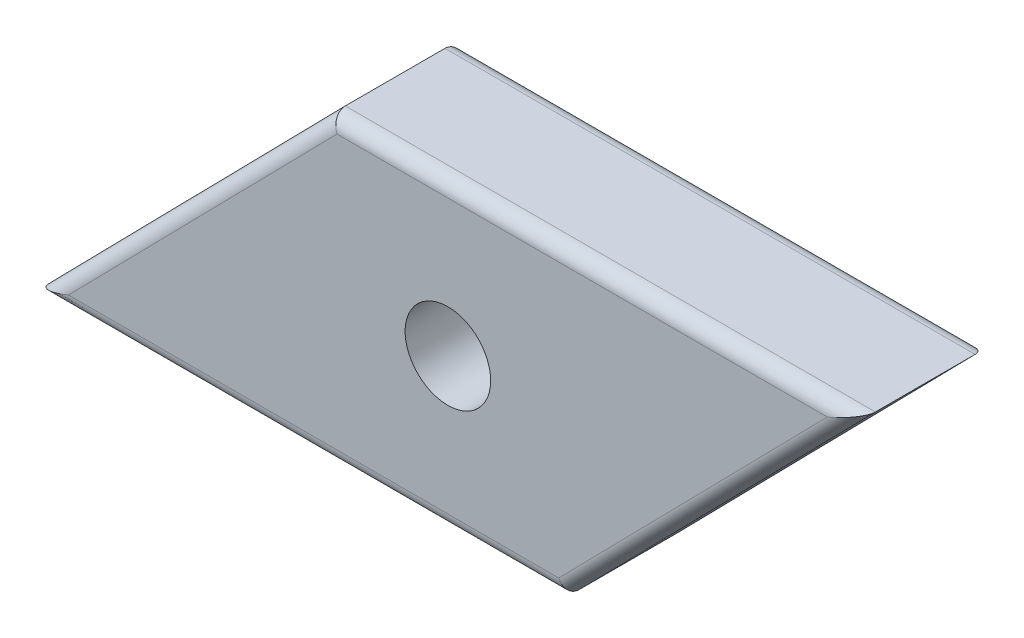
ISO-10303-21;
HEADER;
FILE_DESCRIPTION(('STEP AP214'),'2;1');
FILE_NAME('part.step','',(''),(''),'','','');
FILE_SCHEMA(('AUTOMOTIVE_DESIGN { 1 0 10303 214 1 1 1 1 }'));
ENDSEC;
DATA;
#1=APPLICATION_CONTEXT('core data for automotive mechanical design processes');
#2=APPLICATION_PROTOCOL_DEFINITION('international standard','automotive_design',2000,#1);
#3=PRODUCT_CONTEXT('',#1,'mechanical');
#4=PRODUCT('Part','Part','',(#3));
#5=PRODUCT_RELATED_PRODUCT_CATEGORY('part','',(#4));
#6=PRODUCT_DEFINITION_FORMATION('','',#4);
#7=PRODUCT_DEFINITION_CONTEXT('part definition',#1,'design');
#8=PRODUCT_DEFINITION('design','',#6,#7);
#9=PRODUCT_DEFINITION_SHAPE('','',#8);
#10=(LENGTH_UNIT() NAMED_UNIT(*) SI_UNIT(.MILLI.,.METRE.));
#11=(NAMED_UNIT(*) PLANE_ANGLE_UNIT() SI_UNIT($,.RADIAN.));
#12=(NAMED_UNIT(*) SI_UNIT($,.STERADIAN.) SOLID_ANGLE_UNIT());
#13=UNCERTAINTY_MEASURE_WITH_UNIT(LENGTH_MEASURE(1.E-05),#10,'distance_accuracy_value','');
#14=(GEOMETRIC_REPRESENTATION_CONTEXT(3) GLOBAL_UNCERTAINTY_ASSIGNED_CONTEXT((#13)) GLOBAL_UNIT_ASSIGNED_CONTEXT((#10,
#11,#12)) REPRESENTATION_CONTEXT('',''));
#15=CARTESIAN_POINT('',(0.,0.,0.));
#16=DIRECTION('',(0.,0.,1.));
#17=DIRECTION('',(1.,0.,0.));
#18=AXIS2_PLACEMENT_3D('',#15,#16,#17);
#19=CARTESIAN_POINT('',(0.,0.,4.5));
#20=DIRECTION('',(0.,0.,-1.));
#21=DIRECTION('',(-1.,0.,0.));
#22=AXIS2_PLACEMENT_3D('',#19,#20,#21);
#23=PLANE('',#22);
#24=DIRECTION('',(1.,0.,0.));
#25=VECTOR('',#24,1.);
#26=CARTESIAN_POINT('',(0.,-4.8,4.5));
#27=LINE('',#26,#25);
#28=CARTESIAN_POINT('',(-13.308966234685,-4.8,4.5));
#29=VERTEX_POINT('',#28);
#30=CARTESIAN_POINT('',(3.89009831015675,-4.8,4.5));
#31=VERTEX_POINT('',#30);
#32=EDGE_CURVE('E115',#29,#31,#27,.T.);
#33=ORIENTED_EDGE('',*,*,#32,.T.);
#34=DIRECTION('',(0.700340670128076,0.713808759938233,0.));
#35=VECTOR('',#34,1.);
#36=CARTESIAN_POINT('',(4.38165901564127,-4.29898620402539,4.5));
#37=LINE('',#36,#35);
#38=CARTESIAN_POINT('',(13.308966234685,4.8,4.5));
#39=VERTEX_POINT('',#38);
#40=EDGE_CURVE('E9',#31,#39,#37,.T.);
#41=ORIENTED_EDGE('',*,*,#40,.T.);
#42=DIRECTION('',(-1.,0.,0.));
#43=VECTOR('',#42,1.);
#44=CARTESIAN_POINT('',(0.,4.8,4.5));
#45=LINE('',#44,#43);
#46=CARTESIAN_POINT('',(-3.89009831015673,4.8,4.5));
#47=VERTEX_POINT('',#46);
#48=EDGE_CURVE('E24',#39,#47,#45,.T.);
#49=ORIENTED_EDGE('',*,*,#48,.T.);
#50=DIRECTION('',(-0.700340670128077,-0.713808759938232,0.));
#51=VECTOR('',#50,1.);
#52=CARTESIAN_POINT('',(-4.38165901564126,4.29898620402539,4.5));
#53=LINE('',#52,#51);
#54=EDGE_CURVE('E133',#47,#29,#53,.T.);
#55=ORIENTED_EDGE('',*,*,#54,.T.);
#56=EDGE_LOOP('',(#33,#41,#49,#55));
#57=FACE_BOUND('',#56,.T.);
#58=CARTESIAN_POINT('',(0.,0.,4.5));
#59=DIRECTION('',(0.,0.,1.));
#60=DIRECTION('',(1.,0.,0.));
#61=AXIS2_PLACEMENT_3D('',#58,#59,#60);
#62=CIRCLE('',#61,1.5);
#63=CARTESIAN_POINT('',(1.5,0.,4.5));
#64=VERTEX_POINT('',#63);
#65=EDGE_CURVE('E160',#64,#64,#62,.T.);
#66=ORIENTED_EDGE('',*,*,#65,.F.);
#67=EDGE_LOOP('',(#66));
#68=FACE_BOUND('',#67,.T.);
#69=ADVANCED_FACE('F15',(#57,#68),#23,.F.);
#70=CARTESIAN_POINT('',(0.,0.,0.));
#71=DIRECTION('',(0.,0.,-1.));
#72=DIRECTION('',(-1.,0.,0.));
#73=AXIS2_PLACEMENT_3D('',#70,#71,#72);
#74=PLANE('',#73);
#75=DIRECTION('',(1.,0.,0.));
#76=VECTOR('',#75,1.);
#77=CARTESIAN_POINT('',(-14.5,-4.8,0.));
#78=LINE('',#77,#76);
#79=CARTESIAN_POINT('',(3.89009831015675,-4.8,0.));
#80=VERTEX_POINT('',#79);
#81=CARTESIAN_POINT('',(-13.308966234685,-4.8,0.));
#82=VERTEX_POINT('',#81);
#83=EDGE_CURVE('E151',#80,#82,#78,.F.);
#84=ORIENTED_EDGE('',*,*,#83,.T.);
#85=DIRECTION('',(-0.700340670128077,-0.713808759938232,0.));
#86=VECTOR('',#85,1.);
#87=CARTESIAN_POINT('',(-3.74309562003089,4.94982966493596,0.));
#88=LINE('',#87,#86);
#89=CARTESIAN_POINT('',(-3.89009831015673,4.8,0.));
#90=VERTEX_POINT('',#89);
#91=EDGE_CURVE('E144',#82,#90,#88,.F.);
#92=ORIENTED_EDGE('',*,*,#91,.T.);
#93=DIRECTION('',(-1.,0.,0.));
#94=VECTOR('',#93,1.);
#95=CARTESIAN_POINT('',(14.5,4.8,0.));
#96=LINE('',#95,#94);
#97=CARTESIAN_POINT('',(13.308966234685,4.8,0.));
#98=VERTEX_POINT('',#97);
#99=EDGE_CURVE('E147',#90,#98,#96,.F.);
#100=ORIENTED_EDGE('',*,*,#99,.T.);
#101=DIRECTION('',(0.700340670128076,0.713808759938233,0.));
#102=VECTOR('',#101,1.);
#103=CARTESIAN_POINT('',(3.74309562003089,-4.94982966493597,0.));
#104=LINE('',#103,#102);
#105=EDGE_CURVE('E149',#98,#80,#104,.F.);
#106=ORIENTED_EDGE('',*,*,#105,.T.);
#107=EDGE_LOOP('',(#84,#92,#100,#106));
#108=FACE_BOUND('',#107,.T.);
#109=CARTESIAN_POINT('',(0.,0.,0.));
#110=DIRECTION('',(0.,0.,1.));
#111=DIRECTION('',(1.,0.,0.));
#112=AXIS2_PLACEMENT_3D('',#109,#110,#111);
#113=CIRCLE('',#112,1.5);
#114=CARTESIAN_POINT('',(1.5,0.,0.));
#115=VERTEX_POINT('',#114);
#116=EDGE_CURVE('E127',#115,#115,#113,.T.);
#117=ORIENTED_EDGE('',*,*,#116,.T.);
#118=EDGE_LOOP('',(#117));
#119=FACE_BOUND('',#118,.T.);
#120=ADVANCED_FACE('F170',(#108,#119),#74,.T.);
#121=CARTESIAN_POINT('',(-14.5,-5.3,4.5));
#122=DIRECTION('',(0.713808759938232,-0.700340670128077,0.));
#123=DIRECTION('',(0.700340670128077,0.713808759938232,0.));
#124=AXIS2_PLACEMENT_3D('',#121,#122,#123);
#125=PLANE('',#124);
#126=DIRECTION('',(0.,0.,-1.));
#127=VECTOR('',#126,1.);
#128=CARTESIAN_POINT('',(-4.1,5.3,4.5));
#129=LINE('',#128,#127);
#130=CARTESIAN_POINT('',(-4.1,5.3,4.));
#131=VERTEX_POINT('',#130);
#132=CARTESIAN_POINT('',(-4.1,5.3,0.5));
#133=VERTEX_POINT('',#132);
#134=EDGE_CURVE('E158',#131,#133,#129,.T.);
#135=ORIENTED_EDGE('',*,*,#134,.T.);
#136=DIRECTION('',(-0.700340670128077,-0.713808759938232,0.));
#137=VECTOR('',#136,1.);
#138=CARTESIAN_POINT('',(-14.5,-5.3,0.5));
#139=LINE('',#138,#137);
#140=CARTESIAN_POINT('',(-14.5,-5.3,0.5));
#141=VERTEX_POINT('',#140);
#142=EDGE_CURVE('E104',#133,#141,#139,.T.);
#143=ORIENTED_EDGE('',*,*,#142,.T.);
#144=DIRECTION('',(0.,0.,-1.));
#145=VECTOR('',#144,1.);
#146=CARTESIAN_POINT('',(-14.5,-5.3,4.5));
#147=LINE('',#146,#145);
#148=CARTESIAN_POINT('',(-14.5,-5.3,4.));
#149=VERTEX_POINT('',#148);
#150=EDGE_CURVE('E86',#149,#141,#147,.T.);
#151=ORIENTED_EDGE('',*,*,#150,.F.);
#152=DIRECTION('',(-0.700340670128077,-0.713808759938232,0.));
#153=VECTOR('',#152,1.);
#154=CARTESIAN_POINT('',(-14.5,-5.3,4.));
#155=LINE('',#154,#153);
#156=EDGE_CURVE('E101',#149,#131,#155,.F.);
#157=ORIENTED_EDGE('',*,*,#156,.T.);
#158=EDGE_LOOP('',(#135,#143,#151,#157));
#159=FACE_BOUND('',#158,.T.);
#160=ADVANCED_FACE('F100',(#159),#125,.F.);
#161=CARTESIAN_POINT('',(4.10000000000001,-5.3,4.5));
#162=DIRECTION('',(0.,1.,0.));
#163=DIRECTION('',(0.,0.,1.));
#164=AXIS2_PLACEMENT_3D('',#161,#162,#163);
#165=PLANE('',#164);
#166=ORIENTED_EDGE('',*,*,#150,.T.);
#167=DIRECTION('',(1.,0.,0.));
#168=VECTOR('',#167,1.);
#169=CARTESIAN_POINT('',(4.10000000000001,-5.3,0.5));
#170=LINE('',#169,#168);
#171=CARTESIAN_POINT('',(4.10000000000001,-5.3,0.5));
#172=VERTEX_POINT('',#171);
#173=EDGE_CURVE('E93',#141,#172,#170,.T.);
#174=ORIENTED_EDGE('',*,*,#173,.T.);
#175=DIRECTION('',(0.,0.,-1.));
#176=VECTOR('',#175,1.);
#177=CARTESIAN_POINT('',(4.10000000000001,-5.3,4.5));
#178=LINE('',#177,#176);
#179=CARTESIAN_POINT('',(4.10000000000001,-5.3,4.));
#180=VERTEX_POINT('',#179);
#181=EDGE_CURVE('E88',#180,#172,#178,.T.);
#182=ORIENTED_EDGE('',*,*,#181,.F.);
#183=DIRECTION('',(1.,0.,0.));
#184=VECTOR('',#183,1.);
#185=CARTESIAN_POINT('',(4.10000000000001,-5.3,4.));
#186=LINE('',#185,#184);
#187=EDGE_CURVE('E83',#180,#149,#186,.F.);
#188=ORIENTED_EDGE('',*,*,#187,.T.);
#189=EDGE_LOOP('',(#166,#174,#182,#188));
#190=FACE_BOUND('',#189,.T.);
#191=ADVANCED_FACE('F85',(#190),#165,.F.);
#192=CARTESIAN_POINT('',(14.5,5.3,4.5));
#193=DIRECTION('',(-0.713808759938232,0.700340670128076,0.));
#194=DIRECTION('',(-0.700340670128076,-0.713808759938233,0.));
#195=AXIS2_PLACEMENT_3D('',#192,#193,#194);
#196=PLANE('',#195);
#197=ORIENTED_EDGE('',*,*,#181,.T.);
#198=DIRECTION('',(0.700340670128076,0.713808759938233,0.));
#199=VECTOR('',#198,1.);
#200=CARTESIAN_POINT('',(14.5,5.3,0.5));
#201=LINE('',#200,#199);
#202=CARTESIAN_POINT('',(14.5,5.3,0.5));
#203=VERTEX_POINT('',#202);
#204=EDGE_CURVE('E94',#172,#203,#201,.T.);
#205=ORIENTED_EDGE('',*,*,#204,.T.);
#206=DIRECTION('',(0.,0.,-1.));
#207=VECTOR('',#206,1.);
#208=CARTESIAN_POINT('',(14.5,5.3,4.5));
#209=LINE('',#208,#207);
#210=CARTESIAN_POINT('',(14.5,5.3,4.));
#211=VERTEX_POINT('',#210);
#212=EDGE_CURVE('E155',#211,#203,#209,.T.);
#213=ORIENTED_EDGE('',*,*,#212,.F.);
#214=DIRECTION('',(0.700340670128076,0.713808759938233,0.));
#215=VECTOR('',#214,1.);
#216=CARTESIAN_POINT('',(14.5,5.3,4.));
#217=LINE('',#216,#215);
#218=EDGE_CURVE('E138',#211,#180,#217,.F.);
#219=ORIENTED_EDGE('',*,*,#218,.T.);
#220=EDGE_LOOP('',(#197,#205,#213,#219));
#221=FACE_BOUND('',#220,.T.);
#222=ADVANCED_FACE('F183',(#221),#196,.F.);
#223=CARTESIAN_POINT('',(-4.1,5.3,4.5));
#224=DIRECTION('',(0.,-1.,0.));
#225=DIRECTION('',(0.,0.,-1.));
#226=AXIS2_PLACEMENT_3D('',#223,#224,#225);
#227=PLANE('',#226);
#228=ORIENTED_EDGE('',*,*,#212,.T.);
#229=DIRECTION('',(-1.,0.,0.));
#230=VECTOR('',#229,1.);
#231=CARTESIAN_POINT('',(-4.1,5.3,0.5));
#232=LINE('',#231,#230);
#233=EDGE_CURVE('E140',#203,#133,#232,.T.);
#234=ORIENTED_EDGE('',*,*,#233,.T.);
#235=ORIENTED_EDGE('',*,*,#134,.F.);
#236=DIRECTION('',(-1.,0.,0.));
#237=VECTOR('',#236,1.);
#238=CARTESIAN_POINT('',(-4.1,5.3,4.));
#239=LINE('',#238,#237);
#240=EDGE_CURVE('E142',#131,#211,#239,.F.);
#241=ORIENTED_EDGE('',*,*,#240,.T.);
#242=EDGE_LOOP('',(#228,#234,#235,#241));
#243=FACE_BOUND('',#242,.T.);
#244=ADVANCED_FACE('F180',(#243),#227,.F.);
#245=CARTESIAN_POINT('',(0.,0.,4.5));
#246=DIRECTION('',(0.,0.,-1.));
#247=DIRECTION('',(-1.,0.,0.));
#248=AXIS2_PLACEMENT_3D('',#245,#246,#247);
#249=CYLINDRICAL_SURFACE('',#248,1.5);
#250=ORIENTED_EDGE('',*,*,#65,.T.);
#251=EDGE_LOOP('',(#250));
#252=FACE_BOUND('',#251,.T.);
#253=ORIENTED_EDGE('',*,*,#116,.F.);
#254=EDGE_LOOP('',(#253));
#255=FACE_BOUND('',#254,.T.);
#256=ADVANCED_FACE('F166',(#252,#255),#249,.F.);
#257=CARTESIAN_POINT('',(14.1430956200309,5.65017033506404,0.5));
#258=DIRECTION('',(-0.700340670128076,-0.713808759938233,0.));
#259=DIRECTION('',(0.713808759938233,-0.700340670128076,0.));
#260=AXIS2_PLACEMENT_3D('',#257,#258,#259);
#261=CYLINDRICAL_SURFACE('',#260,0.5);
#262=CARTESIAN_POINT('',(3.89009831015674,-4.8,0.5));
#263=DIRECTION('',(-0.922046818260352,-0.387078370534911,0.));
#264=DIRECTION('',(-0.387078370534911,0.922046818260352,0.));
#265=AXIS2_PLACEMENT_3D('',#262,#263,#264);
#266=ELLIPSE('',#265,0.542271813207232,0.5);
#267=EDGE_CURVE('E128',#80,#172,#266,.T.);
#268=ORIENTED_EDGE('',*,*,#267,.F.);
#269=ORIENTED_EDGE('',*,*,#105,.F.);
#270=CARTESIAN_POINT('',(13.308966234685,4.8,0.5));
#271=DIRECTION('',(0.387078370534911,-0.922046818260352,0.));
#272=DIRECTION('',(-0.922046818260352,-0.387078370534911,0.));
#273=AXIS2_PLACEMENT_3D('',#270,#271,#272);
#274=ELLIPSE('',#273,1.29172807901676,0.5);
#275=EDGE_CURVE('E124',#203,#98,#274,.F.);
#276=ORIENTED_EDGE('',*,*,#275,.F.);
#277=ORIENTED_EDGE('',*,*,#204,.F.);
#278=EDGE_LOOP('',(#268,#269,#276,#277));
#279=FACE_BOUND('',#278,.T.);
#280=ADVANCED_FACE('F203',(#279),#261,.T.);
#281=CARTESIAN_POINT('',(-4.1,4.8,0.5));
#282=DIRECTION('',(1.,0.,0.));
#283=DIRECTION('',(0.,0.,-1.));
#284=AXIS2_PLACEMENT_3D('',#281,#282,#283);
#285=CYLINDRICAL_SURFACE('',#284,0.5);
#286=ORIENTED_EDGE('',*,*,#275,.T.);
#287=ORIENTED_EDGE('',*,*,#99,.F.);
#288=CARTESIAN_POINT('',(-3.89009831015673,4.8,0.5));
#289=DIRECTION('',(0.922046818260352,0.387078370534911,0.));
#290=DIRECTION('',(0.387078370534911,-0.922046818260352,0.));
#291=AXIS2_PLACEMENT_3D('',#288,#289,#290);
#292=ELLIPSE('',#291,0.542271813207232,0.5);
#293=EDGE_CURVE('E117',#133,#90,#292,.F.);
#294=ORIENTED_EDGE('',*,*,#293,.F.);
#295=ORIENTED_EDGE('',*,*,#233,.F.);
#296=EDGE_LOOP('',(#286,#287,#294,#295));
#297=FACE_BOUND('',#296,.T.);
#298=ADVANCED_FACE('F199',(#297),#285,.T.);
#299=CARTESIAN_POINT('',(4.10000000000001,-4.8,0.5));
#300=DIRECTION('',(-1.,0.,0.));
#301=DIRECTION('',(0.,0.,1.));
#302=AXIS2_PLACEMENT_3D('',#299,#300,#301);
#303=CYLINDRICAL_SURFACE('',#302,0.5);
#304=ORIENTED_EDGE('',*,*,#267,.T.);
#305=ORIENTED_EDGE('',*,*,#173,.F.);
#306=CARTESIAN_POINT('',(-13.308966234685,-4.8,0.5));
#307=DIRECTION('',(-0.387078370534911,0.922046818260352,0.));
#308=DIRECTION('',(-0.922046818260352,-0.387078370534911,0.));
#309=AXIS2_PLACEMENT_3D('',#306,#307,#308);
#310=ELLIPSE('',#309,1.29172807901677,0.5);
#311=EDGE_CURVE('E116',#82,#141,#310,.T.);
#312=ORIENTED_EDGE('',*,*,#311,.F.);
#313=ORIENTED_EDGE('',*,*,#83,.F.);
#314=EDGE_LOOP('',(#304,#305,#312,#313));
#315=FACE_BOUND('',#314,.T.);
#316=ADVANCED_FACE('F195',(#315),#303,.T.);
#317=CARTESIAN_POINT('',(-14.1430956200309,-5.65017033506404,0.5));
#318=DIRECTION('',(0.700340670128077,0.713808759938232,0.));
#319=DIRECTION('',(-0.713808759938232,0.700340670128077,0.));
#320=AXIS2_PLACEMENT_3D('',#317,#318,#319);
#321=CYLINDRICAL_SURFACE('',#320,0.5);
#322=ORIENTED_EDGE('',*,*,#293,.T.);
#323=ORIENTED_EDGE('',*,*,#91,.F.);
#324=ORIENTED_EDGE('',*,*,#311,.T.);
#325=ORIENTED_EDGE('',*,*,#142,.F.);
#326=EDGE_LOOP('',(#322,#323,#324,#325));
#327=FACE_BOUND('',#326,.T.);
#328=ADVANCED_FACE('F192',(#327),#321,.T.);
#329=CARTESIAN_POINT('',(-4.38165901564126,4.29898620402539,4.));
#330=DIRECTION('',(-0.700340670128077,-0.713808759938232,0.));
#331=DIRECTION('',(0.713808759938232,-0.700340670128077,0.));
#332=AXIS2_PLACEMENT_3D('',#329,#330,#331);
#333=CYLINDRICAL_SURFACE('',#332,0.5);
#334=CARTESIAN_POINT('',(-3.89009831015673,4.8,4.));
#335=DIRECTION('',(-0.922046818260352,-0.387078370534911,0.));
#336=DIRECTION('',(0.387078370534911,-0.922046818260352,0.));
#337=AXIS2_PLACEMENT_3D('',#334,#335,#336);
#338=ELLIPSE('',#337,0.542271813207232,0.5);
#339=EDGE_CURVE('E111',#131,#47,#338,.F.);
#340=ORIENTED_EDGE('',*,*,#339,.F.);
#341=ORIENTED_EDGE('',*,*,#156,.F.);
#342=CARTESIAN_POINT('',(-13.308966234685,-4.8,4.));
#343=DIRECTION('',(0.387078370534911,-0.922046818260352,0.));
#344=DIRECTION('',(0.922046818260352,0.387078370534911,0.));
#345=AXIS2_PLACEMENT_3D('',#342,#343,#344);
#346=ELLIPSE('',#345,1.29172807901677,0.5);
#347=EDGE_CURVE('E19',#29,#149,#346,.T.);
#348=ORIENTED_EDGE('',*,*,#347,.F.);
#349=ORIENTED_EDGE('',*,*,#54,.F.);
#350=EDGE_LOOP('',(#340,#341,#348,#349));
#351=FACE_BOUND('',#350,.T.);
#352=ADVANCED_FACE('F17',(#351),#333,.T.);
#353=CARTESIAN_POINT('',(0.,-4.8,4.));
#354=DIRECTION('',(1.,0.,0.));
#355=DIRECTION('',(0.,0.,-1.));
#356=AXIS2_PLACEMENT_3D('',#353,#354,#355);
#357=CYLINDRICAL_SURFACE('',#356,0.5);
#358=ORIENTED_EDGE('',*,*,#347,.T.);
#359=ORIENTED_EDGE('',*,*,#187,.F.);
#360=CARTESIAN_POINT('',(3.89009831015675,-4.8,4.));
#361=DIRECTION('',(0.922046818260352,0.387078370534911,0.));
#362=DIRECTION('',(0.387078370534911,-0.922046818260352,0.));
#363=AXIS2_PLACEMENT_3D('',#360,#361,#362);
#364=ELLIPSE('',#363,0.542271813207232,0.5);
#365=EDGE_CURVE('E119',#31,#180,#364,.T.);
#366=ORIENTED_EDGE('',*,*,#365,.F.);
#367=ORIENTED_EDGE('',*,*,#32,.F.);
#368=EDGE_LOOP('',(#358,#359,#366,#367));
#369=FACE_BOUND('',#368,.T.);
#370=ADVANCED_FACE('F114',(#369),#357,.T.);
#371=CARTESIAN_POINT('',(0.,4.8,4.));
#372=DIRECTION('',(-1.,0.,0.));
#373=DIRECTION('',(0.,0.,1.));
#374=AXIS2_PLACEMENT_3D('',#371,#372,#373);
#375=CYLINDRICAL_SURFACE('',#374,0.5);
#376=ORIENTED_EDGE('',*,*,#339,.T.);
#377=ORIENTED_EDGE('',*,*,#48,.F.);
#378=CARTESIAN_POINT('',(13.308966234685,4.8,4.));
#379=DIRECTION('',(-0.387078370534911,0.922046818260352,0.));
#380=DIRECTION('',(-0.922046818260352,-0.387078370534911,0.));
#381=AXIS2_PLACEMENT_3D('',#378,#379,#380);
#382=ELLIPSE('',#381,1.29172807901676,0.5);
#383=EDGE_CURVE('E32',#211,#39,#382,.F.);
#384=ORIENTED_EDGE('',*,*,#383,.F.);
#385=ORIENTED_EDGE('',*,*,#240,.F.);
#386=EDGE_LOOP('',(#376,#377,#384,#385));
#387=FACE_BOUND('',#386,.T.);
#388=ADVANCED_FACE('F211',(#387),#375,.T.);
#389=CARTESIAN_POINT('',(4.38165901564127,-4.29898620402539,4.));
#390=DIRECTION('',(0.700340670128076,0.713808759938233,0.));
#391=DIRECTION('',(-0.713808759938233,0.700340670128076,0.));
#392=AXIS2_PLACEMENT_3D('',#389,#390,#391);
#393=CYLINDRICAL_SURFACE('',#392,0.5);
#394=ORIENTED_EDGE('',*,*,#365,.T.);
#395=ORIENTED_EDGE('',*,*,#218,.F.);
#396=ORIENTED_EDGE('',*,*,#383,.T.);
#397=ORIENTED_EDGE('',*,*,#40,.F.);
#398=EDGE_LOOP('',(#394,#395,#396,#397));
#399=FACE_BOUND('',#398,.T.);
#400=ADVANCED_FACE('F208',(#399),#393,.T.);
#401=CLOSED_SHELL('',(#69,#120,#160,#191,#222,#244,#256,#280,#298,#316,#328,#352,#370,#388,#400));
#402=MANIFOLD_SOLID_BREP('B1',#401);
#403=ADVANCED_BREP_SHAPE_REPRESENTATION('',(#18,#402),#14);
#404=SHAPE_DEFINITION_REPRESENTATION(#9,#403);
ENDSEC;
END-ISO-10303-21;
